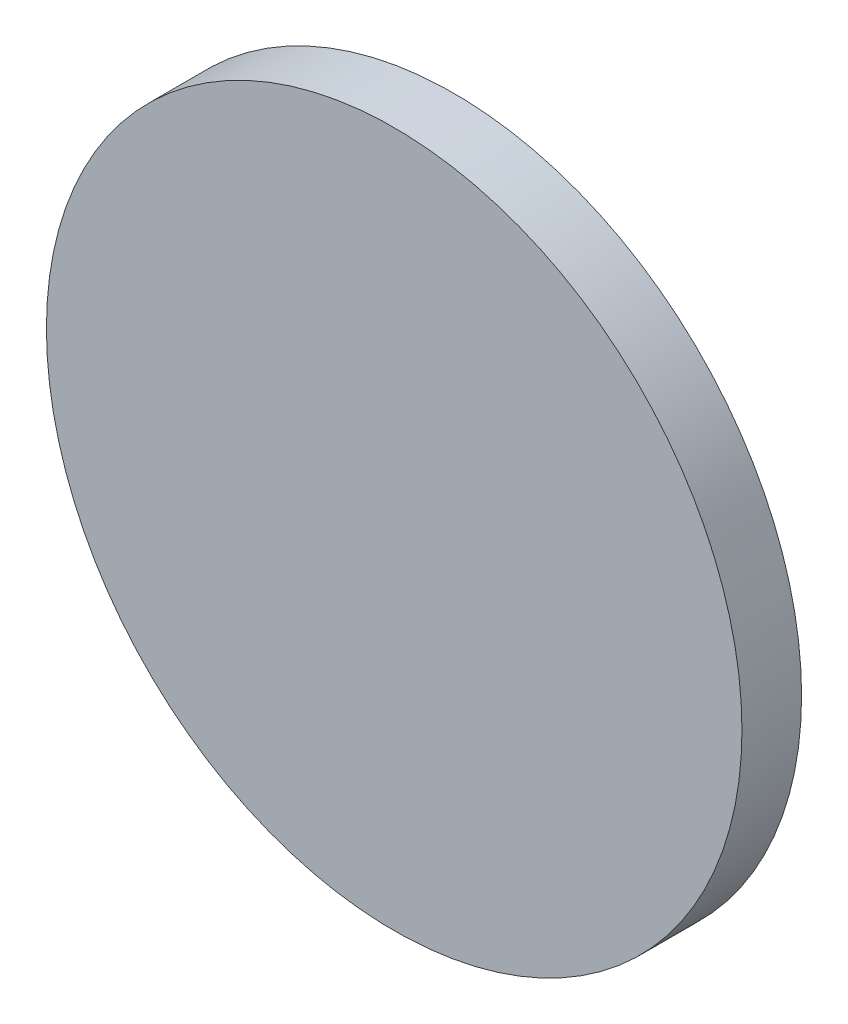
ISO-10303-21;
HEADER;
FILE_DESCRIPTION(('STEP AP214'),'2;1');
FILE_NAME('part.step','',(''),(''),'','','');
FILE_SCHEMA(('AUTOMOTIVE_DESIGN { 1 0 10303 214 1 1 1 1 }'));
ENDSEC;
DATA;
#1=APPLICATION_CONTEXT('core data for automotive mechanical design processes');
#2=APPLICATION_PROTOCOL_DEFINITION('international standard','automotive_design',2000,#1);
#3=PRODUCT_CONTEXT('',#1,'mechanical');
#4=PRODUCT('Part','Part','',(#3));
#5=PRODUCT_RELATED_PRODUCT_CATEGORY('part','',(#4));
#6=PRODUCT_DEFINITION_FORMATION('','',#4);
#7=PRODUCT_DEFINITION_CONTEXT('part definition',#1,'design');
#8=PRODUCT_DEFINITION('design','',#6,#7);
#9=PRODUCT_DEFINITION_SHAPE('','',#8);
#10=(LENGTH_UNIT() NAMED_UNIT(*) SI_UNIT(.MILLI.,.METRE.));
#11=(NAMED_UNIT(*) PLANE_ANGLE_UNIT() SI_UNIT($,.RADIAN.));
#12=(NAMED_UNIT(*) SI_UNIT($,.STERADIAN.) SOLID_ANGLE_UNIT());
#13=UNCERTAINTY_MEASURE_WITH_UNIT(LENGTH_MEASURE(1.E-05),#10,'distance_accuracy_value','');
#14=(GEOMETRIC_REPRESENTATION_CONTEXT(3) GLOBAL_UNCERTAINTY_ASSIGNED_CONTEXT((#13)) GLOBAL_UNIT_ASSIGNED_CONTEXT((#10,
#11,#12)) REPRESENTATION_CONTEXT('',''));
#15=CARTESIAN_POINT('',(0.,0.,0.));
#16=DIRECTION('',(0.,0.,1.));
#17=DIRECTION('',(1.,0.,0.));
#18=AXIS2_PLACEMENT_3D('',#15,#16,#17);
#19=CARTESIAN_POINT('',(9.604,4.807000014875,0.76487));
#20=DIRECTION('',(0.,0.,-1.));
#21=DIRECTION('',(-1.,0.,0.));
#22=AXIS2_PLACEMENT_3D('',#19,#20,#21);
#23=PLANE('',#22);
#24=CARTESIAN_POINT('',(9.604,4.807000014875,0.76487));
#25=DIRECTION('',(0.,0.,1.));
#26=DIRECTION('',(1.,0.,0.));
#27=AXIS2_PLACEMENT_3D('',#24,#25,#26);
#28=CIRCLE('',#27,0.200024667);
#29=CARTESIAN_POINT('',(9.804024667,4.807000014875,0.76487));
#30=VERTEX_POINT('',#29);
#31=EDGE_CURVE('E18',#30,#30,#28,.T.);
#32=ORIENTED_EDGE('',*,*,#31,.F.);
#33=EDGE_LOOP('',(#32));
#34=FACE_BOUND('',#33,.T.);
#35=ADVANCED_FACE('F15',(#34),#23,.T.);
#36=CARTESIAN_POINT('',(9.604,4.807000014875,0.76487));
#37=DIRECTION('',(0.,0.,1.));
#38=DIRECTION('',(1.,0.,0.));
#39=AXIS2_PLACEMENT_3D('',#36,#37,#38);
#40=CYLINDRICAL_SURFACE('',#39,0.200024667);
#41=CARTESIAN_POINT('',(9.604,4.807000014875,0.79916));
#42=DIRECTION('',(0.,0.,1.));
#43=DIRECTION('',(1.,0.,0.));
#44=AXIS2_PLACEMENT_3D('',#41,#42,#43);
#45=CIRCLE('',#44,0.200024667);
#46=CARTESIAN_POINT('',(9.804024667,4.807000014875,0.79916));
#47=VERTEX_POINT('',#46);
#48=EDGE_CURVE('E10',#47,#47,#45,.T.);
#49=ORIENTED_EDGE('',*,*,#48,.F.);
#50=EDGE_LOOP('',(#49));
#51=FACE_BOUND('',#50,.T.);
#52=ORIENTED_EDGE('',*,*,#31,.T.);
#53=EDGE_LOOP('',(#52));
#54=FACE_BOUND('',#53,.T.);
#55=ADVANCED_FACE('F27',(#51,#54),#40,.T.);
#56=CARTESIAN_POINT('',(9.604,4.807000014875,0.79916));
#57=DIRECTION('',(0.,0.,1.));
#58=DIRECTION('',(1.,0.,0.));
#59=AXIS2_PLACEMENT_3D('',#56,#57,#58);
#60=PLANE('',#59);
#61=ORIENTED_EDGE('',*,*,#48,.T.);
#62=EDGE_LOOP('',(#61));
#63=FACE_BOUND('',#62,.T.);
#64=ADVANCED_FACE('F34',(#63),#60,.T.);
#65=CLOSED_SHELL('',(#35,#55,#64));
#66=MANIFOLD_SOLID_BREP('B1',#65);
#67=ADVANCED_BREP_SHAPE_REPRESENTATION('',(#18,#66),#14);
#68=SHAPE_DEFINITION_REPRESENTATION(#9,#67);
ENDSEC;
END-ISO-10303-21;
